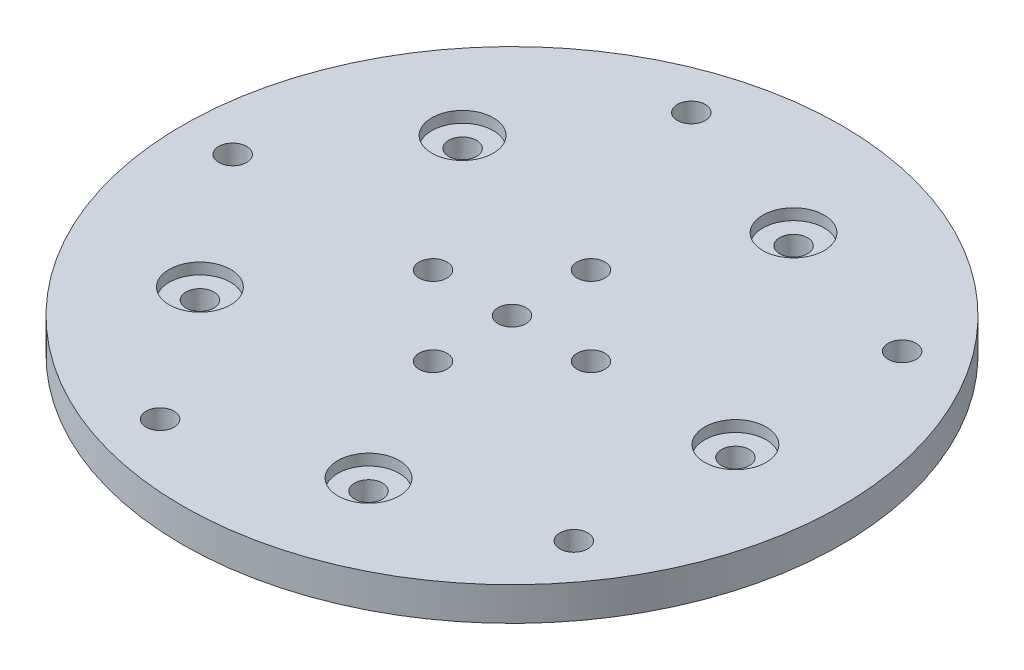
ISO-10303-21;
HEADER;
FILE_DESCRIPTION(('STEP AP214'),'2;1');
FILE_NAME('part.step','',(''),(''),'','','');
FILE_SCHEMA(('AUTOMOTIVE_DESIGN { 1 0 10303 214 1 1 1 1 }'));
ENDSEC;
DATA;
#1=APPLICATION_CONTEXT('core data for automotive mechanical design processes');
#2=APPLICATION_PROTOCOL_DEFINITION('international standard','automotive_design',2000,#1);
#3=PRODUCT_CONTEXT('',#1,'mechanical');
#4=PRODUCT('Part','Part','',(#3));
#5=PRODUCT_RELATED_PRODUCT_CATEGORY('part','',(#4));
#6=PRODUCT_DEFINITION_FORMATION('','',#4);
#7=PRODUCT_DEFINITION_CONTEXT('part definition',#1,'design');
#8=PRODUCT_DEFINITION('design','',#6,#7);
#9=PRODUCT_DEFINITION_SHAPE('','',#8);
#10=(LENGTH_UNIT() NAMED_UNIT(*) SI_UNIT(.MILLI.,.METRE.));
#11=(NAMED_UNIT(*) PLANE_ANGLE_UNIT() SI_UNIT($,.RADIAN.));
#12=(NAMED_UNIT(*) SI_UNIT($,.STERADIAN.) SOLID_ANGLE_UNIT());
#13=UNCERTAINTY_MEASURE_WITH_UNIT(LENGTH_MEASURE(1.E-05),#10,'distance_accuracy_value','');
#14=(GEOMETRIC_REPRESENTATION_CONTEXT(3) GLOBAL_UNCERTAINTY_ASSIGNED_CONTEXT((#13)) GLOBAL_UNIT_ASSIGNED_CONTEXT((#10,
#11,#12)) REPRESENTATION_CONTEXT('',''));
#15=CARTESIAN_POINT('',(0.,0.,0.));
#16=DIRECTION('',(0.,0.,1.));
#17=DIRECTION('',(1.,0.,0.));
#18=AXIS2_PLACEMENT_3D('',#15,#16,#17);
#19=CARTESIAN_POINT('',(6.18033988749895,3.,-19.0211303259031));
#20=DIRECTION('',(0.,1.,0.));
#21=DIRECTION('',(0.,0.,1.));
#22=AXIS2_PLACEMENT_3D('',#19,#20,#21);
#23=CYLINDRICAL_SURFACE('',#22,1.25);
#24=CARTESIAN_POINT('',(6.18033988749895,0.,-19.0211303259031));
#25=DIRECTION('',(0.,1.,0.));
#26=DIRECTION('',(0.,0.,1.));
#27=AXIS2_PLACEMENT_3D('',#24,#25,#26);
#28=CIRCLE('',#27,1.25);
#29=CARTESIAN_POINT('',(6.18033988749895,0.,-17.7711303259031));
#30=VERTEX_POINT('',#29);
#31=EDGE_CURVE('E51',#30,#30,#28,.T.);
#32=ORIENTED_EDGE('',*,*,#31,.F.);
#33=EDGE_LOOP('',(#32));
#34=FACE_BOUND('',#33,.T.);
#35=CARTESIAN_POINT('',(6.18033988749895,2.,-19.0211303259031));
#36=DIRECTION('',(0.,1.,0.));
#37=DIRECTION('',(0.,0.,1.));
#38=AXIS2_PLACEMENT_3D('',#35,#36,#37);
#39=CIRCLE('',#38,1.25);
#40=CARTESIAN_POINT('',(6.18033988749895,2.,-17.7711303259031));
#41=VERTEX_POINT('',#40);
#42=EDGE_CURVE('E69',#41,#41,#39,.F.);
#43=ORIENTED_EDGE('',*,*,#42,.F.);
#44=EDGE_LOOP('',(#43));
#45=FACE_BOUND('',#44,.T.);
#46=ADVANCED_FACE('F38',(#34,#45),#23,.F.);
#47=CARTESIAN_POINT('',(-16.180339887499,3.,-11.7557050458495));
#48=DIRECTION('',(0.,1.,0.));
#49=DIRECTION('',(0.,0.,1.));
#50=AXIS2_PLACEMENT_3D('',#47,#48,#49);
#51=CYLINDRICAL_SURFACE('',#50,1.25);
#52=CARTESIAN_POINT('',(-16.180339887499,0.,-11.7557050458495));
#53=DIRECTION('',(0.,1.,0.));
#54=DIRECTION('',(0.,0.,1.));
#55=AXIS2_PLACEMENT_3D('',#52,#53,#54);
#56=CIRCLE('',#55,1.25);
#57=CARTESIAN_POINT('',(-16.180339887499,0.,-10.5057050458495));
#58=VERTEX_POINT('',#57);
#59=EDGE_CURVE('E161',#58,#58,#56,.T.);
#60=ORIENTED_EDGE('',*,*,#59,.F.);
#61=EDGE_LOOP('',(#60));
#62=FACE_BOUND('',#61,.T.);
#63=CARTESIAN_POINT('',(-16.180339887499,2.,-11.7557050458495));
#64=DIRECTION('',(0.,1.,0.));
#65=DIRECTION('',(0.,0.,1.));
#66=AXIS2_PLACEMENT_3D('',#63,#64,#65);
#67=CIRCLE('',#66,1.25);
#68=CARTESIAN_POINT('',(-16.180339887499,2.,-10.5057050458495));
#69=VERTEX_POINT('',#68);
#70=EDGE_CURVE('E66',#69,#69,#67,.F.);
#71=ORIENTED_EDGE('',*,*,#70,.F.);
#72=EDGE_LOOP('',(#71));
#73=FACE_BOUND('',#72,.T.);
#74=ADVANCED_FACE('F173',(#62,#73),#51,.F.);
#75=CARTESIAN_POINT('',(-16.1803398874989,3.,11.7557050458495));
#76=DIRECTION('',(0.,1.,0.));
#77=DIRECTION('',(0.,0.,1.));
#78=AXIS2_PLACEMENT_3D('',#75,#76,#77);
#79=CYLINDRICAL_SURFACE('',#78,1.25);
#80=CARTESIAN_POINT('',(-16.1803398874989,0.,11.7557050458495));
#81=DIRECTION('',(0.,1.,0.));
#82=DIRECTION('',(0.,0.,1.));
#83=AXIS2_PLACEMENT_3D('',#80,#81,#82);
#84=CIRCLE('',#83,1.25);
#85=CARTESIAN_POINT('',(-16.1803398874989,0.,13.0057050458495));
#86=VERTEX_POINT('',#85);
#87=EDGE_CURVE('E159',#86,#86,#84,.T.);
#88=ORIENTED_EDGE('',*,*,#87,.F.);
#89=EDGE_LOOP('',(#88));
#90=FACE_BOUND('',#89,.T.);
#91=CARTESIAN_POINT('',(-16.1803398874989,2.,11.7557050458495));
#92=DIRECTION('',(0.,1.,0.));
#93=DIRECTION('',(0.,0.,1.));
#94=AXIS2_PLACEMENT_3D('',#91,#92,#93);
#95=CIRCLE('',#94,1.25);
#96=CARTESIAN_POINT('',(-16.1803398874989,2.,13.0057050458495));
#97=VERTEX_POINT('',#96);
#98=EDGE_CURVE('E63',#97,#97,#95,.F.);
#99=ORIENTED_EDGE('',*,*,#98,.F.);
#100=EDGE_LOOP('',(#99));
#101=FACE_BOUND('',#100,.T.);
#102=ADVANCED_FACE('F243',(#90,#101),#79,.F.);
#103=CARTESIAN_POINT('',(6.18033988749895,3.,19.0211303259031));
#104=DIRECTION('',(0.,1.,0.));
#105=DIRECTION('',(0.,0.,1.));
#106=AXIS2_PLACEMENT_3D('',#103,#104,#105);
#107=CYLINDRICAL_SURFACE('',#106,1.25);
#108=CARTESIAN_POINT('',(6.18033988749895,0.,19.0211303259031));
#109=DIRECTION('',(0.,1.,0.));
#110=DIRECTION('',(0.,0.,1.));
#111=AXIS2_PLACEMENT_3D('',#108,#109,#110);
#112=CIRCLE('',#111,1.25);
#113=CARTESIAN_POINT('',(6.18033988749895,0.,20.2711303259031));
#114=VERTEX_POINT('',#113);
#115=EDGE_CURVE('E156',#114,#114,#112,.T.);
#116=ORIENTED_EDGE('',*,*,#115,.F.);
#117=EDGE_LOOP('',(#116));
#118=FACE_BOUND('',#117,.T.);
#119=CARTESIAN_POINT('',(6.18033988749895,2.,19.0211303259031));
#120=DIRECTION('',(0.,1.,0.));
#121=DIRECTION('',(0.,0.,1.));
#122=AXIS2_PLACEMENT_3D('',#119,#120,#121);
#123=CIRCLE('',#122,1.25);
#124=CARTESIAN_POINT('',(6.18033988749895,2.,20.2711303259031));
#125=VERTEX_POINT('',#124);
#126=EDGE_CURVE('E59',#125,#125,#123,.F.);
#127=ORIENTED_EDGE('',*,*,#126,.F.);
#128=EDGE_LOOP('',(#127));
#129=FACE_BOUND('',#128,.T.);
#130=ADVANCED_FACE('F239',(#118,#129),#107,.F.);
#131=CARTESIAN_POINT('',(20.,3.,0.));
#132=DIRECTION('',(0.,1.,0.));
#133=DIRECTION('',(0.,0.,1.));
#134=AXIS2_PLACEMENT_3D('',#131,#132,#133);
#135=CYLINDRICAL_SURFACE('',#134,1.25);
#136=CARTESIAN_POINT('',(20.,0.,0.));
#137=DIRECTION('',(0.,1.,0.));
#138=DIRECTION('',(0.,0.,1.));
#139=AXIS2_PLACEMENT_3D('',#136,#137,#138);
#140=CIRCLE('',#139,1.25);
#141=CARTESIAN_POINT('',(20.,0.,1.25));
#142=VERTEX_POINT('',#141);
#143=EDGE_CURVE('E153',#142,#142,#140,.T.);
#144=ORIENTED_EDGE('',*,*,#143,.F.);
#145=EDGE_LOOP('',(#144));
#146=FACE_BOUND('',#145,.T.);
#147=CARTESIAN_POINT('',(20.,2.,0.));
#148=DIRECTION('',(0.,1.,0.));
#149=DIRECTION('',(0.,0.,1.));
#150=AXIS2_PLACEMENT_3D('',#147,#148,#149);
#151=CIRCLE('',#150,1.25);
#152=CARTESIAN_POINT('',(20.,2.,1.25));
#153=VERTEX_POINT('',#152);
#154=EDGE_CURVE('E56',#153,#153,#151,.F.);
#155=ORIENTED_EDGE('',*,*,#154,.F.);
#156=EDGE_LOOP('',(#155));
#157=FACE_BOUND('',#156,.T.);
#158=ADVANCED_FACE('F236',(#146,#157),#135,.F.);
#159=CARTESIAN_POINT('',(0.,3.,0.));
#160=DIRECTION('',(0.,-1.,0.));
#161=DIRECTION('',(0.,0.,-1.));
#162=AXIS2_PLACEMENT_3D('',#159,#160,#161);
#163=CYLINDRICAL_SURFACE('',#162,29.5);
#164=CARTESIAN_POINT('',(0.,3.,0.));
#165=DIRECTION('',(0.,1.,0.));
#166=DIRECTION('',(0.,0.,1.));
#167=AXIS2_PLACEMENT_3D('',#164,#165,#166);
#168=CIRCLE('',#167,29.5);
#169=CARTESIAN_POINT('',(0.,3.,29.5));
#170=VERTEX_POINT('',#169);
#171=EDGE_CURVE('E10',#170,#170,#168,.T.);
#172=ORIENTED_EDGE('',*,*,#171,.F.);
#173=EDGE_LOOP('',(#172));
#174=FACE_BOUND('',#173,.T.);
#175=CARTESIAN_POINT('',(0.,0.,0.));
#176=DIRECTION('',(0.,1.,0.));
#177=DIRECTION('',(0.,0.,1.));
#178=AXIS2_PLACEMENT_3D('',#175,#176,#177);
#179=CIRCLE('',#178,29.5);
#180=CARTESIAN_POINT('',(0.,0.,29.5));
#181=VERTEX_POINT('',#180);
#182=EDGE_CURVE('E46',#181,#181,#179,.T.);
#183=ORIENTED_EDGE('',*,*,#182,.T.);
#184=EDGE_LOOP('',(#183));
#185=FACE_BOUND('',#184,.T.);
#186=ADVANCED_FACE('F40',(#174,#185),#163,.T.);
#187=CARTESIAN_POINT('',(0.,3.,0.));
#188=DIRECTION('',(0.,1.,0.));
#189=DIRECTION('',(0.,0.,1.));
#190=AXIS2_PLACEMENT_3D('',#187,#188,#189);
#191=PLANE('',#190);
#192=CARTESIAN_POINT('',(20.,3.,0.));
#193=DIRECTION('',(0.,1.,0.));
#194=DIRECTION('',(0.,0.,1.));
#195=AXIS2_PLACEMENT_3D('',#192,#193,#194);
#196=CIRCLE('',#195,2.75);
#197=CARTESIAN_POINT('',(20.,3.,2.75));
#198=VERTEX_POINT('',#197);
#199=EDGE_CURVE('E42',#198,#198,#196,.F.);
#200=ORIENTED_EDGE('',*,*,#199,.T.);
#201=EDGE_LOOP('',(#200));
#202=FACE_BOUND('',#201,.T.);
#203=CARTESIAN_POINT('',(6.18033988749895,3.,19.0211303259031));
#204=DIRECTION('',(0.,1.,0.));
#205=DIRECTION('',(0.,0.,1.));
#206=AXIS2_PLACEMENT_3D('',#203,#204,#205);
#207=CIRCLE('',#206,2.75);
#208=CARTESIAN_POINT('',(6.18033988749895,3.,21.7711303259031));
#209=VERTEX_POINT('',#208);
#210=EDGE_CURVE('E80',#209,#209,#207,.F.);
#211=ORIENTED_EDGE('',*,*,#210,.T.);
#212=EDGE_LOOP('',(#211));
#213=FACE_BOUND('',#212,.T.);
#214=CARTESIAN_POINT('',(-16.1803398874989,3.,11.7557050458495));
#215=DIRECTION('',(0.,1.,0.));
#216=DIRECTION('',(0.,0.,1.));
#217=AXIS2_PLACEMENT_3D('',#214,#215,#216);
#218=CIRCLE('',#217,2.75);
#219=CARTESIAN_POINT('',(-16.1803398874989,3.,14.5057050458495));
#220=VERTEX_POINT('',#219);
#221=EDGE_CURVE('E78',#220,#220,#218,.F.);
#222=ORIENTED_EDGE('',*,*,#221,.T.);
#223=EDGE_LOOP('',(#222));
#224=FACE_BOUND('',#223,.T.);
#225=CARTESIAN_POINT('',(-16.180339887499,3.,-11.7557050458495));
#226=DIRECTION('',(0.,1.,0.));
#227=DIRECTION('',(0.,0.,1.));
#228=AXIS2_PLACEMENT_3D('',#225,#226,#227);
#229=CIRCLE('',#228,2.75);
#230=CARTESIAN_POINT('',(-16.180339887499,3.,-9.00570504584947));
#231=VERTEX_POINT('',#230);
#232=EDGE_CURVE('E75',#231,#231,#229,.F.);
#233=ORIENTED_EDGE('',*,*,#232,.T.);
#234=EDGE_LOOP('',(#233));
#235=FACE_BOUND('',#234,.T.);
#236=CARTESIAN_POINT('',(6.18033988749895,3.,-19.0211303259031));
#237=DIRECTION('',(0.,1.,0.));
#238=DIRECTION('',(0.,0.,1.));
#239=AXIS2_PLACEMENT_3D('',#236,#237,#238);
#240=CIRCLE('',#239,2.75);
#241=CARTESIAN_POINT('',(6.18033988749895,3.,-16.2711303259031));
#242=VERTEX_POINT('',#241);
#243=EDGE_CURVE('E72',#242,#242,#240,.F.);
#244=ORIENTED_EDGE('',*,*,#243,.T.);
#245=EDGE_LOOP('',(#244));
#246=FACE_BOUND('',#245,.T.);
#247=CARTESIAN_POINT('',(-25.,3.,0.));
#248=DIRECTION('',(0.,1.,0.));
#249=DIRECTION('',(0.,0.,1.));
#250=AXIS2_PLACEMENT_3D('',#247,#248,#249);
#251=CIRCLE('',#250,1.25);
#252=CARTESIAN_POINT('',(-25.,3.,1.25));
#253=VERTEX_POINT('',#252);
#254=EDGE_CURVE('E85',#253,#253,#251,.T.);
#255=ORIENTED_EDGE('',*,*,#254,.F.);
#256=EDGE_LOOP('',(#255));
#257=FACE_BOUND('',#256,.T.);
#258=CARTESIAN_POINT('',(-7.07106781186548,3.,0.));
#259=DIRECTION('',(0.,1.,0.));
#260=DIRECTION('',(0.,0.,1.));
#261=AXIS2_PLACEMENT_3D('',#258,#259,#260);
#262=CIRCLE('',#261,1.25);
#263=CARTESIAN_POINT('',(-7.07106781186548,3.,1.25));
#264=VERTEX_POINT('',#263);
#265=EDGE_CURVE('E94',#264,#264,#262,.T.);
#266=ORIENTED_EDGE('',*,*,#265,.F.);
#267=EDGE_LOOP('',(#266));
#268=FACE_BOUND('',#267,.T.);
#269=CARTESIAN_POINT('',(-7.72542485937369,3.,-23.7764129073788));
#270=DIRECTION('',(0.,1.,0.));
#271=DIRECTION('',(0.,0.,1.));
#272=AXIS2_PLACEMENT_3D('',#269,#270,#271);
#273=CIRCLE('',#272,1.25);
#274=CARTESIAN_POINT('',(-7.72542485937369,3.,-22.5264129073788));
#275=VERTEX_POINT('',#274);
#276=EDGE_CURVE('E105',#275,#275,#273,.T.);
#277=ORIENTED_EDGE('',*,*,#276,.F.);
#278=EDGE_LOOP('',(#277));
#279=FACE_BOUND('',#278,.T.);
#280=CARTESIAN_POINT('',(20.2254248593737,3.,-14.6946313073118));
#281=DIRECTION('',(0.,1.,0.));
#282=DIRECTION('',(0.,0.,1.));
#283=AXIS2_PLACEMENT_3D('',#280,#281,#282);
#284=CIRCLE('',#283,1.25);
#285=CARTESIAN_POINT('',(20.2254248593737,3.,-13.4446313073118));
#286=VERTEX_POINT('',#285);
#287=EDGE_CURVE('E111',#286,#286,#284,.T.);
#288=ORIENTED_EDGE('',*,*,#287,.F.);
#289=EDGE_LOOP('',(#288));
#290=FACE_BOUND('',#289,.T.);
#291=CARTESIAN_POINT('',(-7.72542485937369,3.,23.7764129073788));
#292=DIRECTION('',(0.,1.,0.));
#293=DIRECTION('',(0.,0.,1.));
#294=AXIS2_PLACEMENT_3D('',#291,#292,#293);
#295=CIRCLE('',#294,1.25);
#296=CARTESIAN_POINT('',(-7.72542485937369,3.,25.0264129073788));
#297=VERTEX_POINT('',#296);
#298=EDGE_CURVE('E117',#297,#297,#295,.T.);
#299=ORIENTED_EDGE('',*,*,#298,.F.);
#300=EDGE_LOOP('',(#299));
#301=FACE_BOUND('',#300,.T.);
#302=CARTESIAN_POINT('',(0.,3.,-7.07106781186548));
#303=DIRECTION('',(0.,1.,0.));
#304=DIRECTION('',(0.,0.,1.));
#305=AXIS2_PLACEMENT_3D('',#302,#303,#304);
#306=CIRCLE('',#305,1.25);
#307=CARTESIAN_POINT('',(0.,3.,-5.82106781186548));
#308=VERTEX_POINT('',#307);
#309=EDGE_CURVE('E123',#308,#308,#306,.T.);
#310=ORIENTED_EDGE('',*,*,#309,.F.);
#311=EDGE_LOOP('',(#310));
#312=FACE_BOUND('',#311,.T.);
#313=CARTESIAN_POINT('',(7.07106781186548,3.,0.));
#314=DIRECTION('',(0.,1.,0.));
#315=DIRECTION('',(0.,0.,1.));
#316=AXIS2_PLACEMENT_3D('',#313,#314,#315);
#317=CIRCLE('',#316,1.25);
#318=CARTESIAN_POINT('',(7.07106781186548,3.,1.25));
#319=VERTEX_POINT('',#318);
#320=EDGE_CURVE('E129',#319,#319,#317,.T.);
#321=ORIENTED_EDGE('',*,*,#320,.F.);
#322=EDGE_LOOP('',(#321));
#323=FACE_BOUND('',#322,.T.);
#324=CARTESIAN_POINT('',(0.,3.,7.07106781186548));
#325=DIRECTION('',(0.,1.,0.));
#326=DIRECTION('',(0.,0.,1.));
#327=AXIS2_PLACEMENT_3D('',#324,#325,#326);
#328=CIRCLE('',#327,1.25);
#329=CARTESIAN_POINT('',(0.,3.,8.32106781186548));
#330=VERTEX_POINT('',#329);
#331=EDGE_CURVE('E135',#330,#330,#328,.T.);
#332=ORIENTED_EDGE('',*,*,#331,.F.);
#333=EDGE_LOOP('',(#332));
#334=FACE_BOUND('',#333,.T.);
#335=CARTESIAN_POINT('',(0.,3.,0.));
#336=DIRECTION('',(0.,1.,0.));
#337=DIRECTION('',(0.,0.,1.));
#338=AXIS2_PLACEMENT_3D('',#335,#336,#337);
#339=CIRCLE('',#338,1.25);
#340=CARTESIAN_POINT('',(0.,3.,1.25));
#341=VERTEX_POINT('',#340);
#342=EDGE_CURVE('E141',#341,#341,#339,.T.);
#343=ORIENTED_EDGE('',*,*,#342,.F.);
#344=EDGE_LOOP('',(#343));
#345=FACE_BOUND('',#344,.T.);
#346=CARTESIAN_POINT('',(20.2254248593737,3.,14.6946313073118));
#347=DIRECTION('',(0.,1.,0.));
#348=DIRECTION('',(0.,0.,1.));
#349=AXIS2_PLACEMENT_3D('',#346,#347,#348);
#350=CIRCLE('',#349,1.25);
#351=CARTESIAN_POINT('',(20.2254248593737,3.,15.9446313073118));
#352=VERTEX_POINT('',#351);
#353=EDGE_CURVE('E147',#352,#352,#350,.T.);
#354=ORIENTED_EDGE('',*,*,#353,.F.);
#355=EDGE_LOOP('',(#354));
#356=FACE_BOUND('',#355,.T.);
#357=ORIENTED_EDGE('',*,*,#171,.T.);
#358=EDGE_LOOP('',(#357));
#359=FACE_BOUND('',#358,.T.);
#360=ADVANCED_FACE('F251',(#202,#213,#224,#235,#246,#257,#268,#279,#290,#301,#312,#323,#334,
#345,#356,#359),#191,.T.);
#361=CARTESIAN_POINT('',(0.,0.,0.));
#362=DIRECTION('',(0.,1.,0.));
#363=DIRECTION('',(0.,0.,1.));
#364=AXIS2_PLACEMENT_3D('',#361,#362,#363);
#365=PLANE('',#364);
#366=CARTESIAN_POINT('',(-25.,0.,0.));
#367=DIRECTION('',(0.,1.,0.));
#368=DIRECTION('',(0.,0.,1.));
#369=AXIS2_PLACEMENT_3D('',#366,#367,#368);
#370=CIRCLE('',#369,1.25);
#371=CARTESIAN_POINT('',(-25.,0.,1.25));
#372=VERTEX_POINT('',#371);
#373=EDGE_CURVE('E89',#372,#372,#370,.T.);
#374=ORIENTED_EDGE('',*,*,#373,.T.);
#375=EDGE_LOOP('',(#374));
#376=FACE_BOUND('',#375,.T.);
#377=CARTESIAN_POINT('',(-7.07106781186548,0.,0.));
#378=DIRECTION('',(0.,1.,0.));
#379=DIRECTION('',(0.,0.,1.));
#380=AXIS2_PLACEMENT_3D('',#377,#378,#379);
#381=CIRCLE('',#380,1.25);
#382=CARTESIAN_POINT('',(-7.07106781186548,0.,1.25));
#383=VERTEX_POINT('',#382);
#384=EDGE_CURVE('E102',#383,#383,#381,.T.);
#385=ORIENTED_EDGE('',*,*,#384,.T.);
#386=EDGE_LOOP('',(#385));
#387=FACE_BOUND('',#386,.T.);
#388=CARTESIAN_POINT('',(-7.72542485937369,0.,-23.7764129073788));
#389=DIRECTION('',(0.,1.,0.));
#390=DIRECTION('',(0.,0.,1.));
#391=AXIS2_PLACEMENT_3D('',#388,#389,#390);
#392=CIRCLE('',#391,1.25);
#393=CARTESIAN_POINT('',(-7.72542485937369,0.,-22.5264129073788));
#394=VERTEX_POINT('',#393);
#395=EDGE_CURVE('E108',#394,#394,#392,.T.);
#396=ORIENTED_EDGE('',*,*,#395,.T.);
#397=EDGE_LOOP('',(#396));
#398=FACE_BOUND('',#397,.T.);
#399=CARTESIAN_POINT('',(20.2254248593737,0.,-14.6946313073118));
#400=DIRECTION('',(0.,1.,0.));
#401=DIRECTION('',(0.,0.,1.));
#402=AXIS2_PLACEMENT_3D('',#399,#400,#401);
#403=CIRCLE('',#402,1.25);
#404=CARTESIAN_POINT('',(20.2254248593737,0.,-13.4446313073118));
#405=VERTEX_POINT('',#404);
#406=EDGE_CURVE('E114',#405,#405,#403,.T.);
#407=ORIENTED_EDGE('',*,*,#406,.T.);
#408=EDGE_LOOP('',(#407));
#409=FACE_BOUND('',#408,.T.);
#410=CARTESIAN_POINT('',(-7.72542485937369,0.,23.7764129073788));
#411=DIRECTION('',(0.,1.,0.));
#412=DIRECTION('',(0.,0.,1.));
#413=AXIS2_PLACEMENT_3D('',#410,#411,#412);
#414=CIRCLE('',#413,1.25);
#415=CARTESIAN_POINT('',(-7.72542485937369,0.,25.0264129073788));
#416=VERTEX_POINT('',#415);
#417=EDGE_CURVE('E120',#416,#416,#414,.T.);
#418=ORIENTED_EDGE('',*,*,#417,.T.);
#419=EDGE_LOOP('',(#418));
#420=FACE_BOUND('',#419,.T.);
#421=CARTESIAN_POINT('',(0.,0.,-7.07106781186548));
#422=DIRECTION('',(0.,1.,0.));
#423=DIRECTION('',(0.,0.,1.));
#424=AXIS2_PLACEMENT_3D('',#421,#422,#423);
#425=CIRCLE('',#424,1.25);
#426=CARTESIAN_POINT('',(0.,0.,-5.82106781186548));
#427=VERTEX_POINT('',#426);
#428=EDGE_CURVE('E126',#427,#427,#425,.T.);
#429=ORIENTED_EDGE('',*,*,#428,.T.);
#430=EDGE_LOOP('',(#429));
#431=FACE_BOUND('',#430,.T.);
#432=CARTESIAN_POINT('',(7.07106781186548,0.,0.));
#433=DIRECTION('',(0.,1.,0.));
#434=DIRECTION('',(0.,0.,1.));
#435=AXIS2_PLACEMENT_3D('',#432,#433,#434);
#436=CIRCLE('',#435,1.25);
#437=CARTESIAN_POINT('',(7.07106781186548,0.,1.25));
#438=VERTEX_POINT('',#437);
#439=EDGE_CURVE('E132',#438,#438,#436,.T.);
#440=ORIENTED_EDGE('',*,*,#439,.T.);
#441=EDGE_LOOP('',(#440));
#442=FACE_BOUND('',#441,.T.);
#443=CARTESIAN_POINT('',(0.,0.,7.07106781186548));
#444=DIRECTION('',(0.,1.,0.));
#445=DIRECTION('',(0.,0.,1.));
#446=AXIS2_PLACEMENT_3D('',#443,#444,#445);
#447=CIRCLE('',#446,1.25);
#448=CARTESIAN_POINT('',(0.,0.,8.32106781186547));
#449=VERTEX_POINT('',#448);
#450=EDGE_CURVE('E138',#449,#449,#447,.T.);
#451=ORIENTED_EDGE('',*,*,#450,.T.);
#452=EDGE_LOOP('',(#451));
#453=FACE_BOUND('',#452,.T.);
#454=CARTESIAN_POINT('',(0.,0.,0.));
#455=DIRECTION('',(0.,1.,0.));
#456=DIRECTION('',(0.,0.,1.));
#457=AXIS2_PLACEMENT_3D('',#454,#455,#456);
#458=CIRCLE('',#457,1.25);
#459=CARTESIAN_POINT('',(0.,0.,1.25));
#460=VERTEX_POINT('',#459);
#461=EDGE_CURVE('E144',#460,#460,#458,.T.);
#462=ORIENTED_EDGE('',*,*,#461,.T.);
#463=EDGE_LOOP('',(#462));
#464=FACE_BOUND('',#463,.T.);
#465=CARTESIAN_POINT('',(20.2254248593737,0.,14.6946313073118));
#466=DIRECTION('',(0.,1.,0.));
#467=DIRECTION('',(0.,0.,1.));
#468=AXIS2_PLACEMENT_3D('',#465,#466,#467);
#469=CIRCLE('',#468,1.25);
#470=CARTESIAN_POINT('',(20.2254248593737,0.,15.9446313073118));
#471=VERTEX_POINT('',#470);
#472=EDGE_CURVE('E150',#471,#471,#469,.T.);
#473=ORIENTED_EDGE('',*,*,#472,.T.);
#474=EDGE_LOOP('',(#473));
#475=FACE_BOUND('',#474,.T.);
#476=ORIENTED_EDGE('',*,*,#143,.T.);
#477=EDGE_LOOP('',(#476));
#478=FACE_BOUND('',#477,.T.);
#479=ORIENTED_EDGE('',*,*,#115,.T.);
#480=EDGE_LOOP('',(#479));
#481=FACE_BOUND('',#480,.T.);
#482=ORIENTED_EDGE('',*,*,#87,.T.);
#483=EDGE_LOOP('',(#482));
#484=FACE_BOUND('',#483,.T.);
#485=ORIENTED_EDGE('',*,*,#59,.T.);
#486=EDGE_LOOP('',(#485));
#487=FACE_BOUND('',#486,.T.);
#488=ORIENTED_EDGE('',*,*,#31,.T.);
#489=EDGE_LOOP('',(#488));
#490=FACE_BOUND('',#489,.T.);
#491=ORIENTED_EDGE('',*,*,#182,.F.);
#492=EDGE_LOOP('',(#491));
#493=FACE_BOUND('',#492,.T.);
#494=ADVANCED_FACE('F168',(#376,#387,#398,#409,#420,#431,#442,#453,#464,#475,#478,#481,#484,
#487,#490,#493),#365,.F.);
#495=CARTESIAN_POINT('',(20.2254248593737,3.,14.6946313073118));
#496=DIRECTION('',(0.,1.,0.));
#497=DIRECTION('',(0.,0.,1.));
#498=AXIS2_PLACEMENT_3D('',#495,#496,#497);
#499=CYLINDRICAL_SURFACE('',#498,1.25);
#500=ORIENTED_EDGE('',*,*,#472,.F.);
#501=EDGE_LOOP('',(#500));
#502=FACE_BOUND('',#501,.T.);
#503=ORIENTED_EDGE('',*,*,#353,.T.);
#504=EDGE_LOOP('',(#503));
#505=FACE_BOUND('',#504,.T.);
#506=ADVANCED_FACE('F231',(#502,#505),#499,.F.);
#507=CARTESIAN_POINT('',(0.,3.,0.));
#508=DIRECTION('',(0.,1.,0.));
#509=DIRECTION('',(0.,0.,1.));
#510=AXIS2_PLACEMENT_3D('',#507,#508,#509);
#511=CYLINDRICAL_SURFACE('',#510,1.25);
#512=ORIENTED_EDGE('',*,*,#461,.F.);
#513=EDGE_LOOP('',(#512));
#514=FACE_BOUND('',#513,.T.);
#515=ORIENTED_EDGE('',*,*,#342,.T.);
#516=EDGE_LOOP('',(#515));
#517=FACE_BOUND('',#516,.T.);
#518=ADVANCED_FACE('F227',(#514,#517),#511,.F.);
#519=CARTESIAN_POINT('',(0.,3.,7.07106781186548));
#520=DIRECTION('',(0.,1.,0.));
#521=DIRECTION('',(0.,0.,1.));
#522=AXIS2_PLACEMENT_3D('',#519,#520,#521);
#523=CYLINDRICAL_SURFACE('',#522,1.25);
#524=ORIENTED_EDGE('',*,*,#450,.F.);
#525=EDGE_LOOP('',(#524));
#526=FACE_BOUND('',#525,.T.);
#527=ORIENTED_EDGE('',*,*,#331,.T.);
#528=EDGE_LOOP('',(#527));
#529=FACE_BOUND('',#528,.T.);
#530=ADVANCED_FACE('F223',(#526,#529),#523,.F.);
#531=CARTESIAN_POINT('',(7.07106781186548,3.,0.));
#532=DIRECTION('',(0.,1.,0.));
#533=DIRECTION('',(0.,0.,1.));
#534=AXIS2_PLACEMENT_3D('',#531,#532,#533);
#535=CYLINDRICAL_SURFACE('',#534,1.25);
#536=ORIENTED_EDGE('',*,*,#439,.F.);
#537=EDGE_LOOP('',(#536));
#538=FACE_BOUND('',#537,.T.);
#539=ORIENTED_EDGE('',*,*,#320,.T.);
#540=EDGE_LOOP('',(#539));
#541=FACE_BOUND('',#540,.T.);
#542=ADVANCED_FACE('F219',(#538,#541),#535,.F.);
#543=CARTESIAN_POINT('',(0.,3.,-7.07106781186548));
#544=DIRECTION('',(0.,1.,0.));
#545=DIRECTION('',(0.,0.,1.));
#546=AXIS2_PLACEMENT_3D('',#543,#544,#545);
#547=CYLINDRICAL_SURFACE('',#546,1.25);
#548=ORIENTED_EDGE('',*,*,#428,.F.);
#549=EDGE_LOOP('',(#548));
#550=FACE_BOUND('',#549,.T.);
#551=ORIENTED_EDGE('',*,*,#309,.T.);
#552=EDGE_LOOP('',(#551));
#553=FACE_BOUND('',#552,.T.);
#554=ADVANCED_FACE('F215',(#550,#553),#547,.F.);
#555=CARTESIAN_POINT('',(-7.72542485937369,3.,23.7764129073788));
#556=DIRECTION('',(0.,1.,0.));
#557=DIRECTION('',(0.,0.,1.));
#558=AXIS2_PLACEMENT_3D('',#555,#556,#557);
#559=CYLINDRICAL_SURFACE('',#558,1.25);
#560=ORIENTED_EDGE('',*,*,#417,.F.);
#561=EDGE_LOOP('',(#560));
#562=FACE_BOUND('',#561,.T.);
#563=ORIENTED_EDGE('',*,*,#298,.T.);
#564=EDGE_LOOP('',(#563));
#565=FACE_BOUND('',#564,.T.);
#566=ADVANCED_FACE('F211',(#562,#565),#559,.F.);
#567=CARTESIAN_POINT('',(20.2254248593737,3.,-14.6946313073118));
#568=DIRECTION('',(0.,1.,0.));
#569=DIRECTION('',(0.,0.,1.));
#570=AXIS2_PLACEMENT_3D('',#567,#568,#569);
#571=CYLINDRICAL_SURFACE('',#570,1.25);
#572=ORIENTED_EDGE('',*,*,#406,.F.);
#573=EDGE_LOOP('',(#572));
#574=FACE_BOUND('',#573,.T.);
#575=ORIENTED_EDGE('',*,*,#287,.T.);
#576=EDGE_LOOP('',(#575));
#577=FACE_BOUND('',#576,.T.);
#578=ADVANCED_FACE('F207',(#574,#577),#571,.F.);
#579=CARTESIAN_POINT('',(-7.72542485937369,3.,-23.7764129073788));
#580=DIRECTION('',(0.,1.,0.));
#581=DIRECTION('',(0.,0.,1.));
#582=AXIS2_PLACEMENT_3D('',#579,#580,#581);
#583=CYLINDRICAL_SURFACE('',#582,1.25);
#584=ORIENTED_EDGE('',*,*,#395,.F.);
#585=EDGE_LOOP('',(#584));
#586=FACE_BOUND('',#585,.T.);
#587=ORIENTED_EDGE('',*,*,#276,.T.);
#588=EDGE_LOOP('',(#587));
#589=FACE_BOUND('',#588,.T.);
#590=ADVANCED_FACE('F203',(#586,#589),#583,.F.);
#591=CARTESIAN_POINT('',(-7.07106781186548,3.,0.));
#592=DIRECTION('',(0.,1.,0.));
#593=DIRECTION('',(0.,0.,1.));
#594=AXIS2_PLACEMENT_3D('',#591,#592,#593);
#595=CYLINDRICAL_SURFACE('',#594,1.25);
#596=ORIENTED_EDGE('',*,*,#384,.F.);
#597=EDGE_LOOP('',(#596));
#598=FACE_BOUND('',#597,.T.);
#599=ORIENTED_EDGE('',*,*,#265,.T.);
#600=EDGE_LOOP('',(#599));
#601=FACE_BOUND('',#600,.T.);
#602=ADVANCED_FACE('F199',(#598,#601),#595,.F.);
#603=CARTESIAN_POINT('',(-25.,3.,0.));
#604=DIRECTION('',(0.,1.,0.));
#605=DIRECTION('',(0.,0.,1.));
#606=AXIS2_PLACEMENT_3D('',#603,#604,#605);
#607=CYLINDRICAL_SURFACE('',#606,1.25);
#608=ORIENTED_EDGE('',*,*,#373,.F.);
#609=EDGE_LOOP('',(#608));
#610=FACE_BOUND('',#609,.T.);
#611=ORIENTED_EDGE('',*,*,#254,.T.);
#612=EDGE_LOOP('',(#611));
#613=FACE_BOUND('',#612,.T.);
#614=ADVANCED_FACE('F195',(#610,#613),#607,.F.);
#615=CARTESIAN_POINT('',(20.,2.,0.));
#616=DIRECTION('',(0.,1.,0.));
#617=DIRECTION('',(0.,0.,1.));
#618=AXIS2_PLACEMENT_3D('',#615,#616,#617);
#619=PLANE('',#618);
#620=CARTESIAN_POINT('',(20.,2.,0.));
#621=DIRECTION('',(0.,1.,0.));
#622=DIRECTION('',(0.,0.,1.));
#623=AXIS2_PLACEMENT_3D('',#620,#621,#622);
#624=CIRCLE('',#623,2.75);
#625=CARTESIAN_POINT('',(20.,2.,2.75));
#626=VERTEX_POINT('',#625);
#627=EDGE_CURVE('E60',#626,#626,#624,.T.);
#628=ORIENTED_EDGE('',*,*,#627,.T.);
#629=EDGE_LOOP('',(#628));
#630=FACE_BOUND('',#629,.T.);
#631=ORIENTED_EDGE('',*,*,#154,.T.);
#632=EDGE_LOOP('',(#631));
#633=FACE_BOUND('',#632,.T.);
#634=ADVANCED_FACE('F198',(#630,#633),#619,.T.);
#635=CARTESIAN_POINT('',(20.,3.000012,0.));
#636=DIRECTION('',(0.,-1.,0.));
#637=DIRECTION('',(0.,0.,-1.));
#638=AXIS2_PLACEMENT_3D('',#635,#636,#637);
#639=CYLINDRICAL_SURFACE('',#638,2.75);
#640=ORIENTED_EDGE('',*,*,#199,.F.);
#641=EDGE_LOOP('',(#640));
#642=FACE_BOUND('',#641,.T.);
#643=ORIENTED_EDGE('',*,*,#627,.F.);
#644=EDGE_LOOP('',(#643));
#645=FACE_BOUND('',#644,.T.);
#646=ADVANCED_FACE('F324',(#642,#645),#639,.F.);
#647=CARTESIAN_POINT('',(6.18033988749895,2.,19.0211303259031));
#648=DIRECTION('',(0.,1.,0.));
#649=DIRECTION('',(0.,0.,1.));
#650=AXIS2_PLACEMENT_3D('',#647,#648,#649);
#651=PLANE('',#650);
#652=CARTESIAN_POINT('',(6.18033988749895,2.,19.0211303259031));
#653=DIRECTION('',(0.,1.,0.));
#654=DIRECTION('',(0.,0.,1.));
#655=AXIS2_PLACEMENT_3D('',#652,#653,#654);
#656=CIRCLE('',#655,2.75);
#657=CARTESIAN_POINT('',(6.18033988749895,2.,21.7711303259031));
#658=VERTEX_POINT('',#657);
#659=EDGE_CURVE('E314',#658,#658,#656,.T.);
#660=ORIENTED_EDGE('',*,*,#659,.T.);
#661=EDGE_LOOP('',(#660));
#662=FACE_BOUND('',#661,.T.);
#663=ORIENTED_EDGE('',*,*,#126,.T.);
#664=EDGE_LOOP('',(#663));
#665=FACE_BOUND('',#664,.T.);
#666=ADVANCED_FACE('F297',(#662,#665),#651,.T.);
#667=CARTESIAN_POINT('',(6.18033988749895,3.000012,19.0211303259031));
#668=DIRECTION('',(0.,-1.,0.));
#669=DIRECTION('',(0.,0.,-1.));
#670=AXIS2_PLACEMENT_3D('',#667,#668,#669);
#671=CYLINDRICAL_SURFACE('',#670,2.75);
#672=ORIENTED_EDGE('',*,*,#210,.F.);
#673=EDGE_LOOP('',(#672));
#674=FACE_BOUND('',#673,.T.);
#675=ORIENTED_EDGE('',*,*,#659,.F.);
#676=EDGE_LOOP('',(#675));
#677=FACE_BOUND('',#676,.T.);
#678=ADVANCED_FACE('F288',(#674,#677),#671,.F.);
#679=CARTESIAN_POINT('',(-16.1803398874989,2.,11.7557050458495));
#680=DIRECTION('',(0.,1.,0.));
#681=DIRECTION('',(0.,0.,1.));
#682=AXIS2_PLACEMENT_3D('',#679,#680,#681);
#683=PLANE('',#682);
#684=CARTESIAN_POINT('',(-16.1803398874989,2.,11.7557050458495));
#685=DIRECTION('',(0.,1.,0.));
#686=DIRECTION('',(0.,0.,1.));
#687=AXIS2_PLACEMENT_3D('',#684,#685,#686);
#688=CIRCLE('',#687,2.75);
#689=CARTESIAN_POINT('',(-16.1803398874989,2.,14.5057050458495));
#690=VERTEX_POINT('',#689);
#691=EDGE_CURVE('E313',#690,#690,#688,.T.);
#692=ORIENTED_EDGE('',*,*,#691,.T.);
#693=EDGE_LOOP('',(#692));
#694=FACE_BOUND('',#693,.T.);
#695=ORIENTED_EDGE('',*,*,#98,.T.);
#696=EDGE_LOOP('',(#695));
#697=FACE_BOUND('',#696,.T.);
#698=ADVANCED_FACE('F285',(#694,#697),#683,.T.);
#699=CARTESIAN_POINT('',(-16.1803398874989,3.000012,11.7557050458495));
#700=DIRECTION('',(0.,-1.,0.));
#701=DIRECTION('',(0.,0.,-1.));
#702=AXIS2_PLACEMENT_3D('',#699,#700,#701);
#703=CYLINDRICAL_SURFACE('',#702,2.75);
#704=ORIENTED_EDGE('',*,*,#221,.F.);
#705=EDGE_LOOP('',(#704));
#706=FACE_BOUND('',#705,.T.);
#707=ORIENTED_EDGE('',*,*,#691,.F.);
#708=EDGE_LOOP('',(#707));
#709=FACE_BOUND('',#708,.T.);
#710=ADVANCED_FACE('F287',(#706,#709),#703,.F.);
#711=CARTESIAN_POINT('',(-16.180339887499,2.,-11.7557050458495));
#712=DIRECTION('',(0.,1.,0.));
#713=DIRECTION('',(0.,0.,1.));
#714=AXIS2_PLACEMENT_3D('',#711,#712,#713);
#715=PLANE('',#714);
#716=CARTESIAN_POINT('',(-16.180339887499,2.,-11.7557050458495));
#717=DIRECTION('',(0.,1.,0.));
#718=DIRECTION('',(0.,0.,1.));
#719=AXIS2_PLACEMENT_3D('',#716,#717,#718);
#720=CIRCLE('',#719,2.75);
#721=CARTESIAN_POINT('',(-16.180339887499,2.,-9.00570504584947));
#722=VERTEX_POINT('',#721);
#723=EDGE_CURVE('E309',#722,#722,#720,.T.);
#724=ORIENTED_EDGE('',*,*,#723,.T.);
#725=EDGE_LOOP('',(#724));
#726=FACE_BOUND('',#725,.T.);
#727=ORIENTED_EDGE('',*,*,#70,.T.);
#728=EDGE_LOOP('',(#727));
#729=FACE_BOUND('',#728,.T.);
#730=ADVANCED_FACE('F189',(#726,#729),#715,.T.);
#731=CARTESIAN_POINT('',(-16.180339887499,3.000012,-11.7557050458495));
#732=DIRECTION('',(0.,-1.,0.));
#733=DIRECTION('',(0.,0.,-1.));
#734=AXIS2_PLACEMENT_3D('',#731,#732,#733);
#735=CYLINDRICAL_SURFACE('',#734,2.75);
#736=ORIENTED_EDGE('',*,*,#232,.F.);
#737=EDGE_LOOP('',(#736));
#738=FACE_BOUND('',#737,.T.);
#739=ORIENTED_EDGE('',*,*,#723,.F.);
#740=EDGE_LOOP('',(#739));
#741=FACE_BOUND('',#740,.T.);
#742=ADVANCED_FACE('F180',(#738,#741),#735,.F.);
#743=CARTESIAN_POINT('',(6.18033988749895,2.,-19.0211303259031));
#744=DIRECTION('',(0.,1.,0.));
#745=DIRECTION('',(0.,0.,1.));
#746=AXIS2_PLACEMENT_3D('',#743,#744,#745);
#747=PLANE('',#746);
#748=CARTESIAN_POINT('',(6.18033988749895,2.,-19.0211303259031));
#749=DIRECTION('',(0.,1.,0.));
#750=DIRECTION('',(0.,0.,1.));
#751=AXIS2_PLACEMENT_3D('',#748,#749,#750);
#752=CIRCLE('',#751,2.75);
#753=CARTESIAN_POINT('',(6.18033988749895,2.,-16.2711303259031));
#754=VERTEX_POINT('',#753);
#755=EDGE_CURVE('E97',#754,#754,#752,.T.);
#756=ORIENTED_EDGE('',*,*,#755,.T.);
#757=EDGE_LOOP('',(#756));
#758=FACE_BOUND('',#757,.T.);
#759=ORIENTED_EDGE('',*,*,#42,.T.);
#760=EDGE_LOOP('',(#759));
#761=FACE_BOUND('',#760,.T.);
#762=ADVANCED_FACE('F177',(#758,#761),#747,.T.);
#763=CARTESIAN_POINT('',(6.18033988749895,3.000012,-19.0211303259031));
#764=DIRECTION('',(0.,-1.,0.));
#765=DIRECTION('',(0.,0.,-1.));
#766=AXIS2_PLACEMENT_3D('',#763,#764,#765);
#767=CYLINDRICAL_SURFACE('',#766,2.75);
#768=ORIENTED_EDGE('',*,*,#243,.F.);
#769=EDGE_LOOP('',(#768));
#770=FACE_BOUND('',#769,.T.);
#771=ORIENTED_EDGE('',*,*,#755,.F.);
#772=EDGE_LOOP('',(#771));
#773=FACE_BOUND('',#772,.T.);
#774=ADVANCED_FACE('F179',(#770,#773),#767,.F.);
#775=CLOSED_SHELL('',(#46,#74,#102,#130,#158,#186,#360,#494,#506,#518,#530,#542,#554,#566,#578,
#590,#602,#614,#634,#646,#666,#678,#698,#710,#730,#742,#762,#774));
#776=MANIFOLD_SOLID_BREP('B2',#775);
#777=ADVANCED_BREP_SHAPE_REPRESENTATION('',(#18,#776),#14);
#778=SHAPE_DEFINITION_REPRESENTATION(#9,#777);
ENDSEC;
END-ISO-10303-21;
